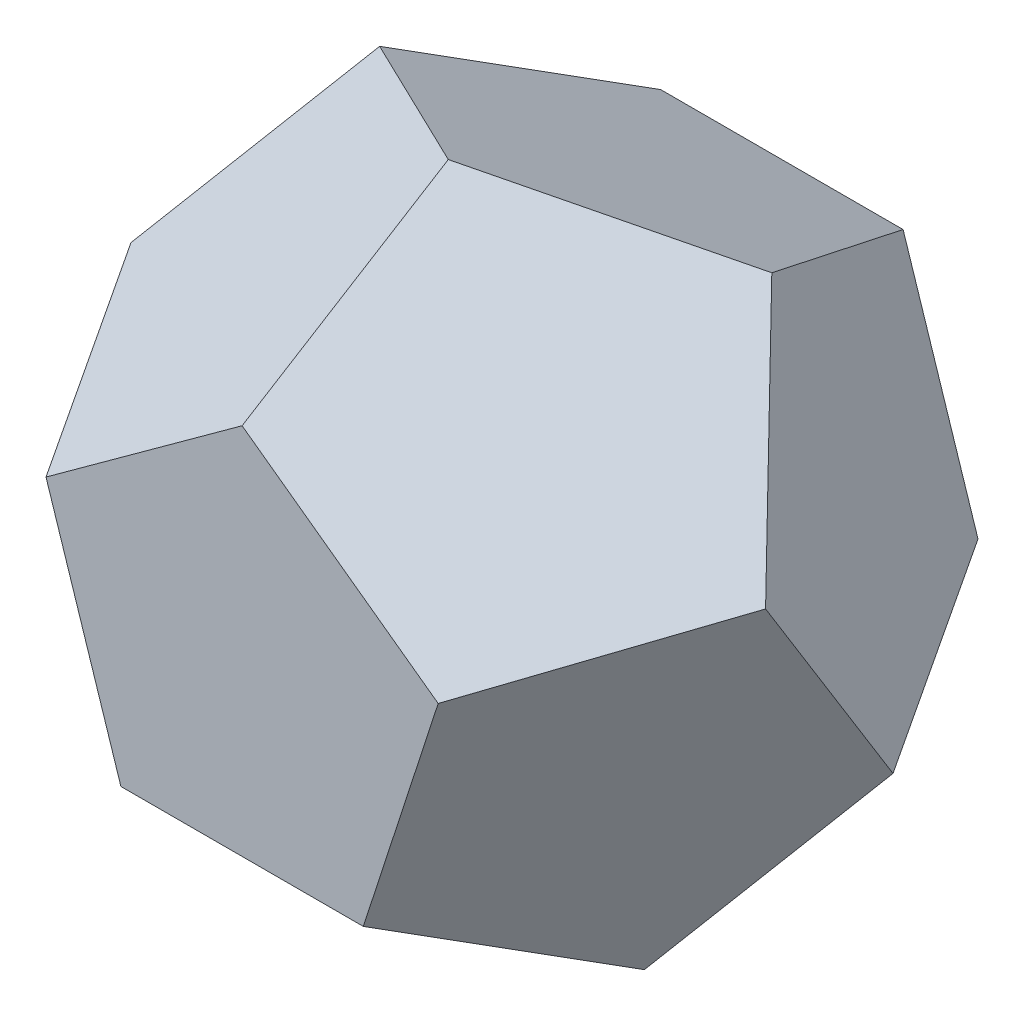
ISO-10303-21;
HEADER;
FILE_DESCRIPTION(('STEP AP214'),'2;1');
FILE_NAME('part.step','',(''),(''),'','','');
FILE_SCHEMA(('AUTOMOTIVE_DESIGN { 1 0 10303 214 1 1 1 1 }'));
ENDSEC;
DATA;
#1=APPLICATION_CONTEXT('core data for automotive mechanical design processes');
#2=APPLICATION_PROTOCOL_DEFINITION('international standard','automotive_design',2000,#1);
#3=PRODUCT_CONTEXT('',#1,'mechanical');
#4=PRODUCT('Part','Part','',(#3));
#5=PRODUCT_RELATED_PRODUCT_CATEGORY('part','',(#4));
#6=PRODUCT_DEFINITION_FORMATION('','',#4);
#7=PRODUCT_DEFINITION_CONTEXT('part definition',#1,'design');
#8=PRODUCT_DEFINITION('design','',#6,#7);
#9=PRODUCT_DEFINITION_SHAPE('','',#8);
#10=(LENGTH_UNIT() NAMED_UNIT(*) SI_UNIT(.MILLI.,.METRE.));
#11=(NAMED_UNIT(*) PLANE_ANGLE_UNIT() SI_UNIT($,.RADIAN.));
#12=(NAMED_UNIT(*) SI_UNIT($,.STERADIAN.) SOLID_ANGLE_UNIT());
#13=UNCERTAINTY_MEASURE_WITH_UNIT(LENGTH_MEASURE(1.E-05),#10,'distance_accuracy_value','');
#14=(GEOMETRIC_REPRESENTATION_CONTEXT(3) GLOBAL_UNCERTAINTY_ASSIGNED_CONTEXT((#13)) GLOBAL_UNIT_ASSIGNED_CONTEXT((#10,
#11,#12)) REPRESENTATION_CONTEXT('',''));
#15=CARTESIAN_POINT('',(0.,0.,0.));
#16=DIRECTION('',(0.,0.,1.));
#17=DIRECTION('',(1.,0.,0.));
#18=AXIS2_PLACEMENT_3D('',#15,#16,#17);
#19=CARTESIAN_POINT('',(33.798673460778,10.9818547139509,-17.7690141866859));
#20=DIRECTION('',(-0.850650808352045,-0.276393202250016,0.447213595499951));
#21=DIRECTION('',(-0.499999999999991,0.688190960235592,-0.525731112119135));
#22=AXIS2_PLACEMENT_3D('',#19,#20,#21);
#23=PLANE('',#22);
#24=DIRECTION('',(0.500000000000004,-0.688190960235585,0.525731112119132));
#25=VECTOR('',#24,1.);
#26=CARTESIAN_POINT('',(28.8675134594812,39.7327236145884,-9.37962370425403));
#27=LINE('',#26,#25);
#28=CARTESIAN_POINT('',(28.8675134594813,39.7327236145884,-9.37962370425397));
#29=VERTEX_POINT('',#28);
#30=CARTESIAN_POINT('',(46.7086179481357,15.1765499551677,9.379623704254));
#31=VERTEX_POINT('',#30);
#32=EDGE_CURVE('E128',#29,#31,#27,.T.);
#33=ORIENTED_EDGE('',*,*,#32,.T.);
#34=DIRECTION('',(0.,-0.850650808352039,-0.525731112119136));
#35=VECTOR('',#34,1.);
#36=CARTESIAN_POINT('',(46.7086179481356,15.1765499551678,9.37962370425404));
#37=LINE('',#36,#35);
#38=CARTESIAN_POINT('',(46.708617948136,-15.1765499551668,-9.37962370425373));
#39=VERTEX_POINT('',#38);
#40=EDGE_CURVE('E158',#31,#39,#37,.T.);
#41=ORIENTED_EDGE('',*,*,#40,.T.);
#42=DIRECTION('',(-0.499999999999992,0.162459848116451,-0.850650808352045));
#43=VECTOR('',#42,1.);
#44=CARTESIAN_POINT('',(46.708617948136,-15.176549955167,-9.37962370425358));
#45=LINE('',#44,#43);
#46=CARTESIAN_POINT('',(28.8675134594817,-9.37962370425383,-39.7327236145881));
#47=VERTEX_POINT('',#46);
#48=EDGE_CURVE('E174',#39,#47,#45,.T.);
#49=ORIENTED_EDGE('',*,*,#48,.T.);
#50=DIRECTION('',(-0.309016994374955,0.951056516295151,0.));
#51=VECTOR('',#50,1.);
#52=CARTESIAN_POINT('',(28.8675134594816,-9.37962370425378,-39.7327236145882));
#53=LINE('',#52,#51);
#54=CARTESIAN_POINT('',(17.8411044886547,24.5561736594213,-39.7327236145883));
#55=VERTEX_POINT('',#54);
#56=EDGE_CURVE('E144',#47,#55,#53,.T.);
#57=ORIENTED_EDGE('',*,*,#56,.T.);
#58=DIRECTION('',(0.309016994374946,0.425325404176017,0.850650808352042));
#59=VECTOR('',#58,1.);
#60=CARTESIAN_POINT('',(17.8411044886548,24.5561736594212,-39.7327236145882));
#61=LINE('',#60,#59);
#62=EDGE_CURVE('E139',#55,#29,#61,.T.);
#63=ORIENTED_EDGE('',*,*,#62,.T.);
#64=EDGE_LOOP('',(#33,#41,#49,#57,#63));
#65=FACE_BOUND('',#64,.T.);
#66=ADVANCED_FACE('F53',(#65),#23,.F.);
#67=CARTESIAN_POINT('',(2.67967142685851E-13,35.5380283733723,-17.7690141866861));
#68=DIRECTION('',(0.,-0.894427190999916,0.447213595499957));
#69=DIRECTION('',(-0.809016994374947,-0.262865556059562,-0.525731112119137));
#70=AXIS2_PLACEMENT_3D('',#67,#68,#69);
#71=PLANE('',#70);
#72=DIRECTION('',(0.809016994374946,0.262865556059573,0.525731112119132));
#73=VECTOR('',#72,1.);
#74=CARTESIAN_POINT('',(-28.8675134594816,39.7327236145882,-9.37962370425403));
#75=LINE('',#74,#73);
#76=CARTESIAN_POINT('',(-28.8675134594815,39.7327236145882,-9.3796237042541));
#77=VERTEX_POINT('',#76);
#78=CARTESIAN_POINT('',(-2.52113145175296E-13,49.1123473188424,9.37962370425395));
#79=VERTEX_POINT('',#78);
#80=EDGE_CURVE('E151',#77,#79,#75,.T.);
#81=ORIENTED_EDGE('',*,*,#80,.T.);
#82=DIRECTION('',(0.809016994374947,-0.262865556059564,-0.525731112119136));
#83=VECTOR('',#82,1.);
#84=CARTESIAN_POINT('',(-1.04083408558608E-13,49.1123473188424,9.37962370425404));
#85=LINE('',#84,#83);
#86=EDGE_CURVE('E132',#79,#29,#85,.T.);
#87=ORIENTED_EDGE('',*,*,#86,.T.);
#88=ORIENTED_EDGE('',*,*,#62,.F.);
#89=DIRECTION('',(-1.,0.,0.));
#90=VECTOR('',#89,1.);
#91=CARTESIAN_POINT('',(17.8411044886546,24.5561736594213,-39.7327236145883));
#92=LINE('',#91,#90);
#93=CARTESIAN_POINT('',(-17.8411044886543,24.5561736594211,-39.7327236145885));
#94=VERTEX_POINT('',#93);
#95=EDGE_CURVE('E177',#55,#94,#92,.T.);
#96=ORIENTED_EDGE('',*,*,#95,.T.);
#97=DIRECTION('',(-0.309016994374951,0.425325404176022,0.850650808352038));
#98=VECTOR('',#97,1.);
#99=CARTESIAN_POINT('',(-17.8411044886543,24.5561736594212,-39.7327236145885));
#100=LINE('',#99,#98);
#101=EDGE_CURVE('E200',#94,#77,#100,.T.);
#102=ORIENTED_EDGE('',*,*,#101,.T.);
#103=EDGE_LOOP('',(#81,#87,#88,#96,#102));
#104=FACE_BOUND('',#103,.T.);
#105=ADVANCED_FACE('F149',(#104),#71,.F.);
#106=CARTESIAN_POINT('',(20.8887289734197,28.7508689006373,17.7690141866861));
#107=DIRECTION('',(-0.525731112119132,-0.723606797749981,-0.447213595499957));
#108=DIRECTION('',(0.500000000000004,-0.688190960235585,0.525731112119132));
#109=AXIS2_PLACEMENT_3D('',#106,#107,#108);
#110=PLANE('',#109);
#111=ORIENTED_EDGE('',*,*,#32,.F.);
#112=ORIENTED_EDGE('',*,*,#86,.F.);
#113=DIRECTION('',(0.,-0.525731112119131,0.850650808352042));
#114=VECTOR('',#113,1.);
#115=CARTESIAN_POINT('',(-3.2612801348364E-13,49.1123473188424,9.37962370425391));
#116=LINE('',#115,#114);
#117=CARTESIAN_POINT('',(0.,30.3530999103344,39.7327236145884));
#118=VERTEX_POINT('',#117);
#119=EDGE_CURVE('E215',#79,#118,#116,.T.);
#120=ORIENTED_EDGE('',*,*,#119,.T.);
#121=DIRECTION('',(0.809016994374947,-0.587785252292474,0.));
#122=VECTOR('',#121,1.);
#123=CARTESIAN_POINT('',(0.,30.3530999103343,39.7327236145884));
#124=LINE('',#123,#122);
#125=CARTESIAN_POINT('',(28.8675134594813,9.37962370425409,39.7327236145884));
#126=VERTEX_POINT('',#125);
#127=EDGE_CURVE('E230',#118,#126,#124,.T.);
#128=ORIENTED_EDGE('',*,*,#127,.T.);
#129=DIRECTION('',(0.499999999999997,0.162459848116463,-0.85065080835204));
#130=VECTOR('',#129,1.);
#131=CARTESIAN_POINT('',(28.8675134594812,9.3796237042543,39.7327236145884));
#132=LINE('',#131,#130);
#133=EDGE_CURVE('E135',#126,#31,#132,.T.);
#134=ORIENTED_EDGE('',*,*,#133,.T.);
#135=EDGE_LOOP('',(#111,#112,#120,#128,#134));
#136=FACE_BOUND('',#135,.T.);
#137=ADVANCED_FACE('F130',(#136),#110,.F.);
#138=CARTESIAN_POINT('',(33.798673460778,-10.9818547139507,17.7690141866861));
#139=DIRECTION('',(-0.850650808352044,0.27639320225001,-0.447213595499957));
#140=DIRECTION('',(-0.49999999999999,-0.688190960235596,0.525731112119132));
#141=AXIS2_PLACEMENT_3D('',#138,#139,#140);
#142=PLANE('',#141);
#143=DIRECTION('',(0.500000000000003,0.688190960235589,-0.525731112119129));
#144=VECTOR('',#143,1.);
#145=CARTESIAN_POINT('',(28.8675134594814,-39.7327236145882,9.37962370425423));
#146=LINE('',#145,#144);
#147=CARTESIAN_POINT('',(28.8675134594816,-39.7327236145881,9.37962370425411));
#148=VERTEX_POINT('',#147);
#149=EDGE_CURVE('E169',#148,#39,#146,.T.);
#150=ORIENTED_EDGE('',*,*,#149,.T.);
#151=ORIENTED_EDGE('',*,*,#40,.F.);
#152=ORIENTED_EDGE('',*,*,#133,.F.);
#153=DIRECTION('',(-0.309016994374948,-0.951056516295153,0.));
#154=VECTOR('',#153,1.);
#155=CARTESIAN_POINT('',(28.8675134594813,9.37962370425398,39.7327236145884));
#156=LINE('',#155,#154);
#157=CARTESIAN_POINT('',(17.8411044886546,-24.5561736594211,39.7327236145884));
#158=VERTEX_POINT('',#157);
#159=EDGE_CURVE('E226',#126,#158,#156,.T.);
#160=ORIENTED_EDGE('',*,*,#159,.T.);
#161=DIRECTION('',(0.309016994374954,-0.425325404176015,-0.85065080835204));
#162=VECTOR('',#161,1.);
#163=CARTESIAN_POINT('',(17.8411044886547,-24.5561736594211,39.7327236145884));
#164=LINE('',#163,#162);
#165=EDGE_CURVE('E246',#158,#148,#164,.T.);
#166=ORIENTED_EDGE('',*,*,#165,.T.);
#167=EDGE_LOOP('',(#150,#151,#152,#160,#166));
#168=FACE_BOUND('',#167,.T.);
#169=ADVANCED_FACE('F332',(#168),#142,.F.);
#170=CARTESIAN_POINT('',(20.88872897342,-28.7508689006372,-17.769014186686));
#171=DIRECTION('',(-0.52573111211914,0.723606797749977,0.447213595499953));
#172=DIRECTION('',(0.500000000000003,0.688190960235589,-0.525731112119128));
#173=AXIS2_PLACEMENT_3D('',#170,#171,#172);
#174=PLANE('',#173);
#175=ORIENTED_EDGE('',*,*,#149,.F.);
#176=DIRECTION('',(-0.809016994374943,-0.262865556059575,-0.525731112119136));
#177=VECTOR('',#176,1.);
#178=CARTESIAN_POINT('',(28.8675134594818,-39.732723614588,9.37962370425404));
#179=LINE('',#178,#177);
#180=CARTESIAN_POINT('',(2.59576861575229E-13,-49.1123473188424,-9.37962370425394));
#181=VERTEX_POINT('',#180);
#182=EDGE_CURVE('E242',#148,#181,#179,.T.);
#183=ORIENTED_EDGE('',*,*,#182,.T.);
#184=DIRECTION('',(0.,0.525731112119131,-0.850650808352042));
#185=VECTOR('',#184,1.);
#186=CARTESIAN_POINT('',(0.,-49.1123473188424,-9.37962370425391));
#187=LINE('',#186,#185);
#188=CARTESIAN_POINT('',(3.68451757768187E-13,-30.3530999103344,-39.7327236145883));
#189=VERTEX_POINT('',#188);
#190=EDGE_CURVE('E268',#181,#189,#187,.T.);
#191=ORIENTED_EDGE('',*,*,#190,.T.);
#192=DIRECTION('',(0.809016994374943,0.587785252292479,0.));
#193=VECTOR('',#192,1.);
#194=CARTESIAN_POINT('',(5.01242164296669E-13,-30.3530999103343,-39.7327236145884));
#195=LINE('',#194,#193);
#196=EDGE_CURVE('E188',#189,#47,#195,.T.);
#197=ORIENTED_EDGE('',*,*,#196,.T.);
#198=ORIENTED_EDGE('',*,*,#48,.F.);
#199=EDGE_LOOP('',(#175,#183,#191,#197,#198));
#200=FACE_BOUND('',#199,.T.);
#201=ADVANCED_FACE('F329',(#200),#174,.F.);
#202=CARTESIAN_POINT('',(2.77452126083494E-13,0.,-39.7327236145884));
#203=DIRECTION('',(0.,0.,1.));
#204=DIRECTION('',(-1.,0.,0.));
#205=AXIS2_PLACEMENT_3D('',#202,#203,#204);
#206=PLANE('',#205);
#207=ORIENTED_EDGE('',*,*,#95,.F.);
#208=ORIENTED_EDGE('',*,*,#56,.F.);
#209=ORIENTED_EDGE('',*,*,#196,.F.);
#210=DIRECTION('',(-0.809016994374948,0.587785252292473,0.));
#211=VECTOR('',#210,1.);
#212=CARTESIAN_POINT('',(3.03791277979923E-13,-30.3530999103345,-39.7327236145883));
#213=LINE('',#212,#211);
#214=CARTESIAN_POINT('',(-28.8675134594811,-9.37962370425411,-39.7327236145885));
#215=VERTEX_POINT('',#214);
#216=EDGE_CURVE('E262',#189,#215,#213,.T.);
#217=ORIENTED_EDGE('',*,*,#216,.T.);
#218=DIRECTION('',(0.309016994374949,0.951056516295153,0.));
#219=VECTOR('',#218,1.);
#220=CARTESIAN_POINT('',(-28.8675134594812,-9.37962370425399,-39.7327236145885));
#221=LINE('',#220,#219);
#222=EDGE_CURVE('E187',#215,#94,#221,.T.);
#223=ORIENTED_EDGE('',*,*,#222,.T.);
#224=EDGE_LOOP('',(#207,#208,#209,#217,#223));
#225=FACE_BOUND('',#224,.T.);
#226=ADVANCED_FACE('F327',(#225),#206,.F.);
#227=CARTESIAN_POINT('',(-33.7986734607777,10.9818547139512,-17.7690141866863));
#228=DIRECTION('',(0.850650808352037,-0.276393202250022,0.447213595499963));
#229=DIRECTION('',(0.,-0.850650808352041,-0.525731112119132));
#230=AXIS2_PLACEMENT_3D('',#227,#228,#229);
#231=PLANE('',#230);
#232=DIRECTION('',(0.,0.850650808352041,0.525731112119132));
#233=VECTOR('',#232,1.);
#234=CARTESIAN_POINT('',(-46.7086179481357,-15.1765499551676,-9.37962370425403));
#235=LINE('',#234,#233);
#236=CARTESIAN_POINT('',(-46.7086179481357,-15.1765499551675,-9.37962370425414));
#237=VERTEX_POINT('',#236);
#238=CARTESIAN_POINT('',(-46.708617948136,15.1765499551668,9.37962370425395));
#239=VERTEX_POINT('',#238);
#240=EDGE_CURVE('E72',#237,#239,#235,.T.);
#241=ORIENTED_EDGE('',*,*,#240,.T.);
#242=DIRECTION('',(0.499999999999996,0.688190960235588,-0.525731112119136));
#243=VECTOR('',#242,1.);
#244=CARTESIAN_POINT('',(-46.7086179481359,15.1765499551669,9.37962370425404));
#245=LINE('',#244,#243);
#246=EDGE_CURVE('E210',#239,#77,#245,.T.);
#247=ORIENTED_EDGE('',*,*,#246,.T.);
#248=ORIENTED_EDGE('',*,*,#101,.F.);
#249=ORIENTED_EDGE('',*,*,#222,.F.);
#250=DIRECTION('',(-0.500000000000007,-0.162459848116451,0.850650808352037));
#251=VECTOR('',#250,1.);
#252=CARTESIAN_POINT('',(-28.867513459481,-9.37962370425417,-39.7327236145886));
#253=LINE('',#252,#251);
#254=EDGE_CURVE('E259',#215,#237,#253,.T.);
#255=ORIENTED_EDGE('',*,*,#254,.T.);
#256=EDGE_LOOP('',(#241,#247,#248,#249,#255));
#257=FACE_BOUND('',#256,.T.);
#258=ADVANCED_FACE('F306',(#257),#231,.F.);
#259=CARTESIAN_POINT('',(-20.8887289734199,28.7508689006372,17.7690141866861));
#260=DIRECTION('',(0.525731112119138,-0.723606797749977,-0.447213595499957));
#261=DIRECTION('',(0.809016994374947,0.262865556059573,0.525731112119132));
#262=AXIS2_PLACEMENT_3D('',#259,#260,#261);
#263=PLANE('',#262);
#264=ORIENTED_EDGE('',*,*,#80,.F.);
#265=ORIENTED_EDGE('',*,*,#246,.F.);
#266=DIRECTION('',(0.499999999999999,-0.162459848116447,0.850650808352042));
#267=VECTOR('',#266,1.);
#268=CARTESIAN_POINT('',(-46.708617948136,15.1765499551667,9.37962370425391));
#269=LINE('',#268,#267);
#270=CARTESIAN_POINT('',(-28.8675134594814,9.37962370425386,39.7327236145883));
#271=VERTEX_POINT('',#270);
#272=EDGE_CURVE('E292',#239,#271,#269,.T.);
#273=ORIENTED_EDGE('',*,*,#272,.T.);
#274=DIRECTION('',(0.809016994374948,0.587785252292473,0.));
#275=VECTOR('',#274,1.);
#276=CARTESIAN_POINT('',(-28.8675134594813,9.37962370425401,39.7327236145884));
#277=LINE('',#276,#275);
#278=EDGE_CURVE('E214',#271,#118,#277,.T.);
#279=ORIENTED_EDGE('',*,*,#278,.T.);
#280=ORIENTED_EDGE('',*,*,#119,.F.);
#281=EDGE_LOOP('',(#264,#265,#273,#279,#280));
#282=FACE_BOUND('',#281,.T.);
#283=ADVANCED_FACE('F325',(#282),#263,.F.);
#284=CARTESIAN_POINT('',(0.,0.,39.7327236145884));
#285=DIRECTION('',(0.,0.,-1.));
#286=DIRECTION('',(-1.,0.,0.));
#287=AXIS2_PLACEMENT_3D('',#284,#285,#286);
#288=PLANE('',#287);
#289=DIRECTION('',(1.,0.,0.));
#290=VECTOR('',#289,1.);
#291=CARTESIAN_POINT('',(-17.8411044886543,-24.5561736594215,39.7327236145883));
#292=LINE('',#291,#290);
#293=CARTESIAN_POINT('',(-17.8411044886544,-24.5561736594213,39.7327236145883));
#294=VERTEX_POINT('',#293);
#295=EDGE_CURVE('E229',#294,#158,#292,.T.);
#296=ORIENTED_EDGE('',*,*,#295,.T.);
#297=ORIENTED_EDGE('',*,*,#159,.F.);
#298=ORIENTED_EDGE('',*,*,#127,.F.);
#299=ORIENTED_EDGE('',*,*,#278,.F.);
#300=DIRECTION('',(0.309016994374956,-0.951056516295151,0.));
#301=VECTOR('',#300,1.);
#302=CARTESIAN_POINT('',(-28.8675134594815,9.37962370425378,39.7327236145883));
#303=LINE('',#302,#301);
#304=EDGE_CURVE('E286',#271,#294,#303,.T.);
#305=ORIENTED_EDGE('',*,*,#304,.T.);
#306=EDGE_LOOP('',(#296,#297,#298,#299,#305));
#307=FACE_BOUND('',#306,.T.);
#308=ADVANCED_FACE('F322',(#307),#288,.F.);
#309=CARTESIAN_POINT('',(3.92047505570758E-13,-35.5380283733723,17.7690141866861));
#310=DIRECTION('',(0.,0.894427190999916,-0.447213595499957));
#311=DIRECTION('',(-0.809016994374952,0.262865556059556,0.525731112119132));
#312=AXIS2_PLACEMENT_3D('',#309,#310,#311);
#313=PLANE('',#312);
#314=DIRECTION('',(0.809016994374952,-0.262865556059567,-0.525731112119126));
#315=VECTOR('',#314,1.);
#316=CARTESIAN_POINT('',(-28.8675134594814,-39.7327236145884,9.37962370425383));
#317=LINE('',#316,#315);
#318=CARTESIAN_POINT('',(-28.8675134594811,-39.7327236145885,9.37962370425397));
#319=VERTEX_POINT('',#318);
#320=EDGE_CURVE('E245',#319,#181,#317,.T.);
#321=ORIENTED_EDGE('',*,*,#320,.T.);
#322=ORIENTED_EDGE('',*,*,#182,.F.);
#323=ORIENTED_EDGE('',*,*,#165,.F.);
#324=ORIENTED_EDGE('',*,*,#295,.F.);
#325=DIRECTION('',(-0.309016994374942,-0.425325404176024,-0.85065080835204));
#326=VECTOR('',#325,1.);
#327=CARTESIAN_POINT('',(-17.8411044886544,-24.5561736594213,39.7327236145884));
#328=LINE('',#327,#326);
#329=EDGE_CURVE('E63',#294,#319,#328,.T.);
#330=ORIENTED_EDGE('',*,*,#329,.T.);
#331=EDGE_LOOP('',(#321,#322,#323,#324,#330));
#332=FACE_BOUND('',#331,.T.);
#333=ADVANCED_FACE('F317',(#332),#313,.F.);
#334=CARTESIAN_POINT('',(-20.8887289734196,-28.7508689006373,-17.7690141866863));
#335=DIRECTION('',(0.525731112119129,0.72360679774998,0.44721359549996));
#336=DIRECTION('',(0.809016994374952,-0.262865556059568,-0.525731112119126));
#337=AXIS2_PLACEMENT_3D('',#334,#335,#336);
#338=PLANE('',#337);
#339=ORIENTED_EDGE('',*,*,#320,.F.);
#340=DIRECTION('',(-0.500000000000005,0.688190960235582,-0.525731112119136));
#341=VECTOR('',#340,1.);
#342=CARTESIAN_POINT('',(-28.867513459481,-39.7327236145886,9.37962370425404));
#343=LINE('',#342,#341);
#344=EDGE_CURVE('E13',#319,#237,#343,.T.);
#345=ORIENTED_EDGE('',*,*,#344,.T.);
#346=ORIENTED_EDGE('',*,*,#254,.F.);
#347=ORIENTED_EDGE('',*,*,#216,.F.);
#348=ORIENTED_EDGE('',*,*,#190,.F.);
#349=EDGE_LOOP('',(#339,#345,#346,#347,#348));
#350=FACE_BOUND('',#349,.T.);
#351=ADVANCED_FACE('F311',(#350),#338,.F.);
#352=CARTESIAN_POINT('',(-33.7986734607777,-10.9818547139514,17.7690141866861));
#353=DIRECTION('',(0.850650808352038,0.276393202250028,-0.447213595499957));
#354=DIRECTION('',(0.,0.850650808352041,0.525731112119132));
#355=AXIS2_PLACEMENT_3D('',#352,#353,#354);
#356=PLANE('',#355);
#357=ORIENTED_EDGE('',*,*,#240,.F.);
#358=ORIENTED_EDGE('',*,*,#344,.F.);
#359=ORIENTED_EDGE('',*,*,#329,.F.);
#360=ORIENTED_EDGE('',*,*,#304,.F.);
#361=ORIENTED_EDGE('',*,*,#272,.F.);
#362=EDGE_LOOP('',(#357,#358,#359,#360,#361));
#363=FACE_BOUND('',#362,.T.);
#364=ADVANCED_FACE('F314',(#363),#356,.F.);
#365=CLOSED_SHELL('',(#66,#105,#137,#169,#201,#226,#258,#283,#308,#333,#351,#364));
#366=MANIFOLD_SOLID_BREP('B2',#365);
#367=ADVANCED_BREP_SHAPE_REPRESENTATION('',(#18,#366),#14);
#368=SHAPE_DEFINITION_REPRESENTATION(#9,#367);
ENDSEC;
END-ISO-10303-21;
